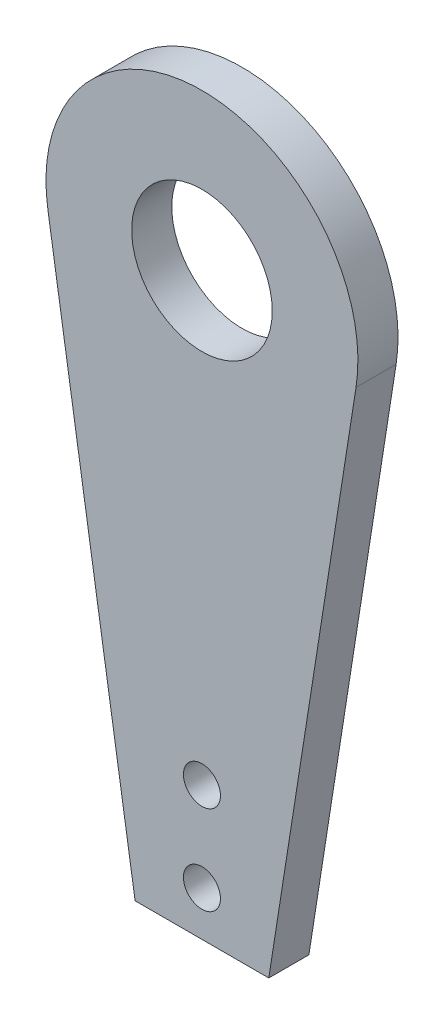
ISO-10303-21;
HEADER;
FILE_DESCRIPTION(('STEP AP214'),'2;1');
FILE_NAME('part.step','',(''),(''),'','','');
FILE_SCHEMA(('AUTOMOTIVE_DESIGN { 1 0 10303 214 1 1 1 1 }'));
ENDSEC;
DATA;
#1=APPLICATION_CONTEXT('core data for automotive mechanical design processes');
#2=APPLICATION_PROTOCOL_DEFINITION('international standard','automotive_design',2000,#1);
#3=PRODUCT_CONTEXT('',#1,'mechanical');
#4=PRODUCT('Part','Part','',(#3));
#5=PRODUCT_RELATED_PRODUCT_CATEGORY('part','',(#4));
#6=PRODUCT_DEFINITION_FORMATION('','',#4);
#7=PRODUCT_DEFINITION_CONTEXT('part definition',#1,'design');
#8=PRODUCT_DEFINITION('design','',#6,#7);
#9=PRODUCT_DEFINITION_SHAPE('','',#8);
#10=(LENGTH_UNIT() NAMED_UNIT(*) SI_UNIT(.MILLI.,.METRE.));
#11=(NAMED_UNIT(*) PLANE_ANGLE_UNIT() SI_UNIT($,.RADIAN.));
#12=(NAMED_UNIT(*) SI_UNIT($,.STERADIAN.) SOLID_ANGLE_UNIT());
#13=UNCERTAINTY_MEASURE_WITH_UNIT(LENGTH_MEASURE(1.E-05),#10,'distance_accuracy_value','');
#14=(GEOMETRIC_REPRESENTATION_CONTEXT(3) GLOBAL_UNCERTAINTY_ASSIGNED_CONTEXT((#13)) GLOBAL_UNIT_ASSIGNED_CONTEXT((#10,
#11,#12)) REPRESENTATION_CONTEXT('',''));
#15=CARTESIAN_POINT('',(0.,0.,0.));
#16=DIRECTION('',(0.,0.,1.));
#17=DIRECTION('',(1.,0.,0.));
#18=AXIS2_PLACEMENT_3D('',#15,#16,#17);
#19=CARTESIAN_POINT('',(0.,60.,4.5));
#20=DIRECTION('',(0.,0.,1.));
#21=DIRECTION('',(1.,0.,0.));
#22=AXIS2_PLACEMENT_3D('',#19,#20,#21);
#23=PLANE('',#22);
#24=CARTESIAN_POINT('',(0.,10.,4.5));
#25=DIRECTION('',(0.,0.,1.));
#26=DIRECTION('',(1.,0.,0.));
#27=AXIS2_PLACEMENT_3D('',#24,#25,#26);
#28=CIRCLE('',#27,2.075);
#29=CARTESIAN_POINT('',(2.075,10.,4.5));
#30=VERTEX_POINT('',#29);
#31=EDGE_CURVE('E123',#30,#30,#28,.T.);
#32=ORIENTED_EDGE('',*,*,#31,.F.);
#33=EDGE_LOOP('',(#32));
#34=FACE_BOUND('',#33,.T.);
#35=DIRECTION('',(0.155245078426991,-0.987875986966075,0.));
#36=VECTOR('',#35,1.);
#37=CARTESIAN_POINT('',(-7.5,-5.,4.5));
#38=LINE('',#37,#36);
#39=CARTESIAN_POINT('',(-17.2878297719063,57.2832111275277,4.5));
#40=VERTEX_POINT('',#39);
#41=CARTESIAN_POINT('',(-7.5,-5.,4.5));
#42=VERTEX_POINT('',#41);
#43=EDGE_CURVE('E93',#40,#42,#38,.T.);
#44=ORIENTED_EDGE('',*,*,#43,.T.);
#45=DIRECTION('',(1.,0.,0.));
#46=VECTOR('',#45,1.);
#47=CARTESIAN_POINT('',(-7.5,-5.,4.5));
#48=LINE('',#47,#46);
#49=CARTESIAN_POINT('',(7.5,-5.,4.5));
#50=VERTEX_POINT('',#49);
#51=EDGE_CURVE('E88',#42,#50,#48,.T.);
#52=ORIENTED_EDGE('',*,*,#51,.T.);
#53=DIRECTION('',(0.155245078426991,0.987875986966075,0.));
#54=VECTOR('',#53,1.);
#55=CARTESIAN_POINT('',(17.2878297719063,57.2832111275277,4.5));
#56=LINE('',#55,#54);
#57=CARTESIAN_POINT('',(17.2878297719063,57.2832111275277,4.5));
#58=VERTEX_POINT('',#57);
#59=EDGE_CURVE('E91',#50,#58,#56,.T.);
#60=ORIENTED_EDGE('',*,*,#59,.T.);
#61=CARTESIAN_POINT('',(0.,60.,4.5));
#62=DIRECTION('',(0.,0.,1.));
#63=DIRECTION('',(1.,0.,0.));
#64=AXIS2_PLACEMENT_3D('',#61,#62,#63);
#65=CIRCLE('',#64,17.5);
#66=EDGE_CURVE('E58',#58,#40,#65,.T.);
#67=ORIENTED_EDGE('',*,*,#66,.T.);
#68=EDGE_LOOP('',(#44,#52,#60,#67));
#69=FACE_BOUND('',#68,.T.);
#70=CARTESIAN_POINT('',(0.,0.,4.5));
#71=DIRECTION('',(0.,0.,1.));
#72=DIRECTION('',(1.,0.,0.));
#73=AXIS2_PLACEMENT_3D('',#70,#71,#72);
#74=CIRCLE('',#73,2.075);
#75=CARTESIAN_POINT('',(2.075,0.,4.5));
#76=VERTEX_POINT('',#75);
#77=EDGE_CURVE('E108',#76,#76,#74,.T.);
#78=ORIENTED_EDGE('',*,*,#77,.F.);
#79=EDGE_LOOP('',(#78));
#80=FACE_BOUND('',#79,.T.);
#81=CARTESIAN_POINT('',(0.,60.,4.5));
#82=DIRECTION('',(0.,0.,1.));
#83=DIRECTION('',(1.,0.,0.));
#84=AXIS2_PLACEMENT_3D('',#81,#82,#83);
#85=CIRCLE('',#84,7.8875);
#86=CARTESIAN_POINT('',(7.8875,60.,4.5));
#87=VERTEX_POINT('',#86);
#88=EDGE_CURVE('E129',#87,#87,#85,.T.);
#89=ORIENTED_EDGE('',*,*,#88,.F.);
#90=EDGE_LOOP('',(#89));
#91=FACE_BOUND('',#90,.T.);
#92=ADVANCED_FACE('F41',(#34,#69,#80,#91),#23,.T.);
#93=CARTESIAN_POINT('',(0.,60.,0.));
#94=DIRECTION('',(0.,0.,1.));
#95=DIRECTION('',(1.,0.,0.));
#96=AXIS2_PLACEMENT_3D('',#93,#94,#95);
#97=PLANE('',#96);
#98=DIRECTION('',(0.155245078426991,-0.987875986966075,0.));
#99=VECTOR('',#98,1.);
#100=CARTESIAN_POINT('',(-7.5,-5.,0.));
#101=LINE('',#100,#99);
#102=CARTESIAN_POINT('',(-17.2878297719063,57.2832111275277,0.));
#103=VERTEX_POINT('',#102);
#104=CARTESIAN_POINT('',(-7.5,-5.,0.));
#105=VERTEX_POINT('',#104);
#106=EDGE_CURVE('E105',#103,#105,#101,.T.);
#107=ORIENTED_EDGE('',*,*,#106,.F.);
#108=CARTESIAN_POINT('',(0.,60.,0.));
#109=DIRECTION('',(0.,0.,1.));
#110=DIRECTION('',(1.,0.,0.));
#111=AXIS2_PLACEMENT_3D('',#108,#109,#110);
#112=CIRCLE('',#111,17.5);
#113=CARTESIAN_POINT('',(17.2878297719063,57.2832111275277,0.));
#114=VERTEX_POINT('',#113);
#115=EDGE_CURVE('E81',#114,#103,#112,.T.);
#116=ORIENTED_EDGE('',*,*,#115,.F.);
#117=DIRECTION('',(0.155245078426991,0.987875986966075,0.));
#118=VECTOR('',#117,1.);
#119=CARTESIAN_POINT('',(17.2878297719063,57.2832111275277,0.));
#120=LINE('',#119,#118);
#121=CARTESIAN_POINT('',(7.5,-5.,0.));
#122=VERTEX_POINT('',#121);
#123=EDGE_CURVE('E75',#122,#114,#120,.T.);
#124=ORIENTED_EDGE('',*,*,#123,.F.);
#125=DIRECTION('',(1.,0.,0.));
#126=VECTOR('',#125,1.);
#127=CARTESIAN_POINT('',(-7.5,-5.,0.));
#128=LINE('',#127,#126);
#129=EDGE_CURVE('E97',#105,#122,#128,.T.);
#130=ORIENTED_EDGE('',*,*,#129,.F.);
#131=EDGE_LOOP('',(#107,#116,#124,#130));
#132=FACE_BOUND('',#131,.T.);
#133=CARTESIAN_POINT('',(0.,0.,0.));
#134=DIRECTION('',(0.,0.,1.));
#135=DIRECTION('',(1.,0.,0.));
#136=AXIS2_PLACEMENT_3D('',#133,#134,#135);
#137=CIRCLE('',#136,2.075);
#138=CARTESIAN_POINT('',(2.075,0.,0.));
#139=VERTEX_POINT('',#138);
#140=EDGE_CURVE('E120',#139,#139,#137,.T.);
#141=ORIENTED_EDGE('',*,*,#140,.T.);
#142=EDGE_LOOP('',(#141));
#143=FACE_BOUND('',#142,.T.);
#144=CARTESIAN_POINT('',(0.,10.,0.));
#145=DIRECTION('',(0.,0.,1.));
#146=DIRECTION('',(1.,0.,0.));
#147=AXIS2_PLACEMENT_3D('',#144,#145,#146);
#148=CIRCLE('',#147,2.075);
#149=CARTESIAN_POINT('',(2.075,10.,0.));
#150=VERTEX_POINT('',#149);
#151=EDGE_CURVE('E126',#150,#150,#148,.T.);
#152=ORIENTED_EDGE('',*,*,#151,.T.);
#153=EDGE_LOOP('',(#152));
#154=FACE_BOUND('',#153,.T.);
#155=CARTESIAN_POINT('',(0.,60.,0.));
#156=DIRECTION('',(0.,0.,1.));
#157=DIRECTION('',(1.,0.,0.));
#158=AXIS2_PLACEMENT_3D('',#155,#156,#157);
#159=CIRCLE('',#158,7.8875);
#160=CARTESIAN_POINT('',(7.8875,60.,0.));
#161=VERTEX_POINT('',#160);
#162=EDGE_CURVE('E132',#161,#161,#159,.T.);
#163=ORIENTED_EDGE('',*,*,#162,.T.);
#164=EDGE_LOOP('',(#163));
#165=FACE_BOUND('',#164,.T.);
#166=ADVANCED_FACE('F116',(#132,#143,#154,#165),#97,.F.);
#167=CARTESIAN_POINT('',(-7.5,-5.,4.5));
#168=DIRECTION('',(0.987875986966075,0.155245078426991,0.));
#169=DIRECTION('',(-0.155245078426991,0.987875986966075,0.));
#170=AXIS2_PLACEMENT_3D('',#167,#168,#169);
#171=PLANE('',#170);
#172=ORIENTED_EDGE('',*,*,#106,.T.);
#173=DIRECTION('',(0.,0.,-1.));
#174=VECTOR('',#173,1.);
#175=CARTESIAN_POINT('',(-7.5,-5.,4.5));
#176=LINE('',#175,#174);
#177=EDGE_CURVE('E11',#42,#105,#176,.T.);
#178=ORIENTED_EDGE('',*,*,#177,.F.);
#179=ORIENTED_EDGE('',*,*,#43,.F.);
#180=DIRECTION('',(0.,0.,-1.));
#181=VECTOR('',#180,1.);
#182=CARTESIAN_POINT('',(-17.2878297719063,57.2832111275277,4.5));
#183=LINE('',#182,#181);
#184=EDGE_CURVE('E101',#40,#103,#183,.T.);
#185=ORIENTED_EDGE('',*,*,#184,.T.);
#186=EDGE_LOOP('',(#172,#178,#179,#185));
#187=FACE_BOUND('',#186,.T.);
#188=ADVANCED_FACE('F43',(#187),#171,.F.);
#189=CARTESIAN_POINT('',(-7.5,-5.,4.5));
#190=DIRECTION('',(0.,1.,0.));
#191=DIRECTION('',(0.,0.,1.));
#192=AXIS2_PLACEMENT_3D('',#189,#190,#191);
#193=PLANE('',#192);
#194=ORIENTED_EDGE('',*,*,#129,.T.);
#195=DIRECTION('',(0.,0.,-1.));
#196=VECTOR('',#195,1.);
#197=CARTESIAN_POINT('',(7.5,-5.,4.5));
#198=LINE('',#197,#196);
#199=EDGE_CURVE('E50',#50,#122,#198,.T.);
#200=ORIENTED_EDGE('',*,*,#199,.F.);
#201=ORIENTED_EDGE('',*,*,#51,.F.);
#202=ORIENTED_EDGE('',*,*,#177,.T.);
#203=EDGE_LOOP('',(#194,#200,#201,#202));
#204=FACE_BOUND('',#203,.T.);
#205=ADVANCED_FACE('F96',(#204),#193,.F.);
#206=CARTESIAN_POINT('',(17.2878297719063,57.2832111275277,4.5));
#207=DIRECTION('',(-0.987875986966075,0.155245078426991,0.));
#208=DIRECTION('',(-0.155245078426991,-0.987875986966075,0.));
#209=AXIS2_PLACEMENT_3D('',#206,#207,#208);
#210=PLANE('',#209);
#211=ORIENTED_EDGE('',*,*,#123,.T.);
#212=DIRECTION('',(0.,0.,-1.));
#213=VECTOR('',#212,1.);
#214=CARTESIAN_POINT('',(17.2878297719063,57.2832111275277,4.5));
#215=LINE('',#214,#213);
#216=EDGE_CURVE('E98',#58,#114,#215,.T.);
#217=ORIENTED_EDGE('',*,*,#216,.F.);
#218=ORIENTED_EDGE('',*,*,#59,.F.);
#219=ORIENTED_EDGE('',*,*,#199,.T.);
#220=EDGE_LOOP('',(#211,#217,#218,#219));
#221=FACE_BOUND('',#220,.T.);
#222=ADVANCED_FACE('F99',(#221),#210,.F.);
#223=CARTESIAN_POINT('',(0.,60.,4.5));
#224=DIRECTION('',(0.,0.,-1.));
#225=DIRECTION('',(-1.,0.,0.));
#226=AXIS2_PLACEMENT_3D('',#223,#224,#225);
#227=CYLINDRICAL_SURFACE('',#226,17.5);
#228=ORIENTED_EDGE('',*,*,#115,.T.);
#229=ORIENTED_EDGE('',*,*,#184,.F.);
#230=ORIENTED_EDGE('',*,*,#66,.F.);
#231=ORIENTED_EDGE('',*,*,#216,.T.);
#232=EDGE_LOOP('',(#228,#229,#230,#231));
#233=FACE_BOUND('',#232,.T.);
#234=ADVANCED_FACE('F113',(#233),#227,.T.);
#235=CARTESIAN_POINT('',(0.,0.,4.5));
#236=DIRECTION('',(0.,0.,-1.));
#237=DIRECTION('',(-1.,0.,0.));
#238=AXIS2_PLACEMENT_3D('',#235,#236,#237);
#239=CYLINDRICAL_SURFACE('',#238,2.075);
#240=ORIENTED_EDGE('',*,*,#77,.T.);
#241=EDGE_LOOP('',(#240));
#242=FACE_BOUND('',#241,.T.);
#243=ORIENTED_EDGE('',*,*,#140,.F.);
#244=EDGE_LOOP('',(#243));
#245=FACE_BOUND('',#244,.T.);
#246=ADVANCED_FACE('F150',(#242,#245),#239,.F.);
#247=CARTESIAN_POINT('',(0.,10.,4.5));
#248=DIRECTION('',(0.,0.,-1.));
#249=DIRECTION('',(-1.,0.,0.));
#250=AXIS2_PLACEMENT_3D('',#247,#248,#249);
#251=CYLINDRICAL_SURFACE('',#250,2.075);
#252=ORIENTED_EDGE('',*,*,#31,.T.);
#253=EDGE_LOOP('',(#252));
#254=FACE_BOUND('',#253,.T.);
#255=ORIENTED_EDGE('',*,*,#151,.F.);
#256=EDGE_LOOP('',(#255));
#257=FACE_BOUND('',#256,.T.);
#258=ADVANCED_FACE('F195',(#254,#257),#251,.F.);
#259=CARTESIAN_POINT('',(0.,60.,4.5));
#260=DIRECTION('',(0.,0.,-1.));
#261=DIRECTION('',(-1.,0.,0.));
#262=AXIS2_PLACEMENT_3D('',#259,#260,#261);
#263=CYLINDRICAL_SURFACE('',#262,7.8875);
#264=ORIENTED_EDGE('',*,*,#88,.T.);
#265=EDGE_LOOP('',(#264));
#266=FACE_BOUND('',#265,.T.);
#267=ORIENTED_EDGE('',*,*,#162,.F.);
#268=EDGE_LOOP('',(#267));
#269=FACE_BOUND('',#268,.T.);
#270=ADVANCED_FACE('F138',(#266,#269),#263,.F.);
#271=CLOSED_SHELL('',(#92,#166,#188,#205,#222,#234,#246,#258,#270));
#272=MANIFOLD_SOLID_BREP('B2',#271);
#273=ADVANCED_BREP_SHAPE_REPRESENTATION('',(#18,#272),#14);
#274=SHAPE_DEFINITION_REPRESENTATION(#9,#273);
ENDSEC;
END-ISO-10303-21;
